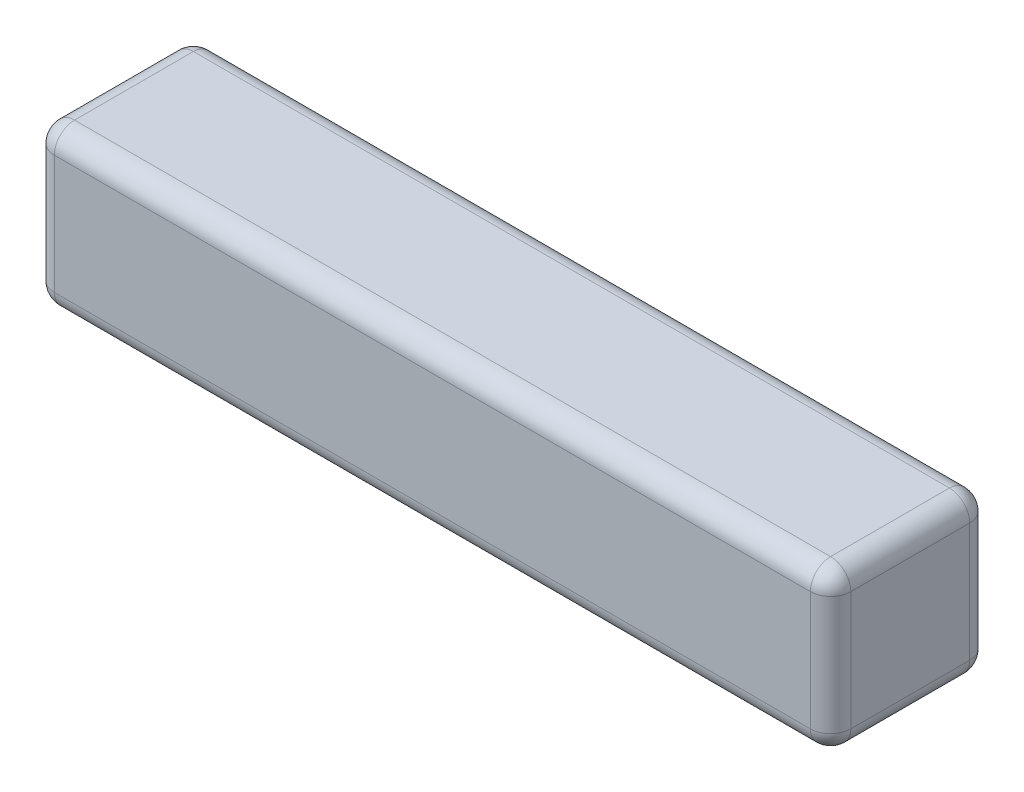
ISO-10303-21;
HEADER;
FILE_DESCRIPTION(('STEP AP214'),'2;1');
FILE_NAME('part.step','',(''),(''),'','','');
FILE_SCHEMA(('AUTOMOTIVE_DESIGN { 1 0 10303 214 1 1 1 1 }'));
ENDSEC;
DATA;
#1=APPLICATION_CONTEXT('core data for automotive mechanical design processes');
#2=APPLICATION_PROTOCOL_DEFINITION('international standard','automotive_design',2000,#1);
#3=PRODUCT_CONTEXT('',#1,'mechanical');
#4=PRODUCT('Part','Part','',(#3));
#5=PRODUCT_RELATED_PRODUCT_CATEGORY('part','',(#4));
#6=PRODUCT_DEFINITION_FORMATION('','',#4);
#7=PRODUCT_DEFINITION_CONTEXT('part definition',#1,'design');
#8=PRODUCT_DEFINITION('design','',#6,#7);
#9=PRODUCT_DEFINITION_SHAPE('','',#8);
#10=(LENGTH_UNIT() NAMED_UNIT(*) SI_UNIT(.MILLI.,.METRE.));
#11=(NAMED_UNIT(*) PLANE_ANGLE_UNIT() SI_UNIT($,.RADIAN.));
#12=(NAMED_UNIT(*) SI_UNIT($,.STERADIAN.) SOLID_ANGLE_UNIT());
#13=UNCERTAINTY_MEASURE_WITH_UNIT(LENGTH_MEASURE(1.E-05),#10,'distance_accuracy_value','');
#14=(GEOMETRIC_REPRESENTATION_CONTEXT(3) GLOBAL_UNCERTAINTY_ASSIGNED_CONTEXT((#13)) GLOBAL_UNIT_ASSIGNED_CONTEXT((#10,
#11,#12)) REPRESENTATION_CONTEXT('',''));
#15=CARTESIAN_POINT('',(0.,0.,0.));
#16=DIRECTION('',(0.,0.,1.));
#17=DIRECTION('',(1.,0.,0.));
#18=AXIS2_PLACEMENT_3D('',#15,#16,#17);
#19=CARTESIAN_POINT('',(9.746,-21.0707501147141,-3.74600000000002));
#20=DIRECTION('',(1.,0.,0.));
#21=DIRECTION('',(0.,0.,-1.));
#22=AXIS2_PLACEMENT_3D('',#19,#20,#21);
#23=SPHERICAL_SURFACE('',#22,0.254);
#24=CARTESIAN_POINT('',(9.746,-21.0707501147141,-3.74600000000002));
#25=DIRECTION('',(0.,0.,-1.));
#26=DIRECTION('',(0.,1.,0.));
#27=AXIS2_PLACEMENT_3D('',#24,#25,#26);
#28=CIRCLE('',#27,0.254000000000001);
#29=CARTESIAN_POINT('',(10.,-21.0707501147141,-3.74600000000002));
#30=VERTEX_POINT('',#29);
#31=CARTESIAN_POINT('',(9.746,-20.8167501147141,-3.74600000000001));
#32=VERTEX_POINT('',#31);
#33=EDGE_CURVE('E296',#30,#32,#28,.F.);
#34=ORIENTED_EDGE('',*,*,#33,.F.);
#35=CARTESIAN_POINT('',(9.746,-21.0707501147141,-3.74600000000001));
#36=DIRECTION('',(0.,-1.,0.));
#37=DIRECTION('',(0.,0.,-1.));
#38=AXIS2_PLACEMENT_3D('',#35,#36,#37);
#39=CIRCLE('',#38,0.254);
#40=CARTESIAN_POINT('',(9.746,-21.0707501147141,-4.00000000000002));
#41=VERTEX_POINT('',#40);
#42=EDGE_CURVE('E134',#41,#30,#39,.T.);
#43=ORIENTED_EDGE('',*,*,#42,.F.);
#44=CARTESIAN_POINT('',(9.746,-21.0707501147141,-3.74600000000002));
#45=DIRECTION('',(-1.,0.,0.));
#46=DIRECTION('',(0.,0.,1.));
#47=AXIS2_PLACEMENT_3D('',#44,#45,#46);
#48=CIRCLE('',#47,0.254);
#49=EDGE_CURVE('E104',#32,#41,#48,.T.);
#50=ORIENTED_EDGE('',*,*,#49,.F.);
#51=EDGE_LOOP('',(#34,#43,#50));
#52=FACE_BOUND('',#51,.T.);
#53=ADVANCED_FACE('F17',(#52),#23,.T.);
#54=CARTESIAN_POINT('',(9.746,-22.5627501147141,-3.74600000000002));
#55=DIRECTION('',(1.,0.,0.));
#56=DIRECTION('',(0.,0.,-1.));
#57=AXIS2_PLACEMENT_3D('',#54,#55,#56);
#58=SPHERICAL_SURFACE('',#57,0.254);
#59=CARTESIAN_POINT('',(9.746,-22.5627501147141,-3.74600000000001));
#60=DIRECTION('',(0.,0.,1.));
#61=DIRECTION('',(0.,-1.,0.));
#62=AXIS2_PLACEMENT_3D('',#59,#60,#61);
#63=CIRCLE('',#62,0.254000000000001);
#64=CARTESIAN_POINT('',(9.746,-22.8167501147141,-3.74600000000001));
#65=VERTEX_POINT('',#64);
#66=CARTESIAN_POINT('',(10.,-22.5627501147141,-3.74600000000002));
#67=VERTEX_POINT('',#66);
#68=EDGE_CURVE('E288',#65,#67,#63,.T.);
#69=ORIENTED_EDGE('',*,*,#68,.F.);
#70=CARTESIAN_POINT('',(9.746,-22.5627501147141,-3.74600000000002));
#71=DIRECTION('',(-1.,0.,0.));
#72=DIRECTION('',(0.,0.,1.));
#73=AXIS2_PLACEMENT_3D('',#70,#71,#72);
#74=CIRCLE('',#73,0.254);
#75=CARTESIAN_POINT('',(9.746,-22.5627501147141,-4.00000000000001));
#76=VERTEX_POINT('',#75);
#77=EDGE_CURVE('E287',#76,#65,#74,.T.);
#78=ORIENTED_EDGE('',*,*,#77,.F.);
#79=CARTESIAN_POINT('',(9.746,-22.5627501147141,-3.74600000000001));
#80=DIRECTION('',(0.,-1.,0.));
#81=DIRECTION('',(0.,0.,-1.));
#82=AXIS2_PLACEMENT_3D('',#79,#80,#81);
#83=CIRCLE('',#82,0.254);
#84=EDGE_CURVE('E283',#67,#76,#83,.F.);
#85=ORIENTED_EDGE('',*,*,#84,.F.);
#86=EDGE_LOOP('',(#69,#78,#85));
#87=FACE_BOUND('',#86,.T.);
#88=ADVANCED_FACE('F155',(#87),#58,.T.);
#89=CARTESIAN_POINT('',(10.,-20.8167501147141,-4.00000000000002));
#90=DIRECTION('',(0.,0.,1.));
#91=DIRECTION('',(0.,-1.,0.));
#92=AXIS2_PLACEMENT_3D('',#89,#90,#91);
#93=PLANE('',#92);
#94=DIRECTION('',(-1.,0.,0.));
#95=VECTOR('',#94,1.);
#96=CARTESIAN_POINT('',(10.,-22.5627501147141,-4.00000000000002));
#97=LINE('',#96,#95);
#98=CARTESIAN_POINT('',(0.254000000000004,-22.5627501147141,-4.00000000000002));
#99=VERTEX_POINT('',#98);
#100=EDGE_CURVE('E117',#99,#76,#97,.F.);
#101=ORIENTED_EDGE('',*,*,#100,.F.);
#102=DIRECTION('',(0.,-1.,0.));
#103=VECTOR('',#102,1.);
#104=CARTESIAN_POINT('',(0.254000000000004,-20.8167501147141,-4.00000000000002));
#105=LINE('',#104,#103);
#106=CARTESIAN_POINT('',(0.254000000000004,-21.0707501147141,-4.00000000000002));
#107=VERTEX_POINT('',#106);
#108=EDGE_CURVE('E111',#107,#99,#105,.T.);
#109=ORIENTED_EDGE('',*,*,#108,.F.);
#110=DIRECTION('',(-1.,0.,0.));
#111=VECTOR('',#110,1.);
#112=CARTESIAN_POINT('',(10.,-21.0707501147141,-4.00000000000002));
#113=LINE('',#112,#111);
#114=EDGE_CURVE('E115',#41,#107,#113,.T.);
#115=ORIENTED_EDGE('',*,*,#114,.F.);
#116=DIRECTION('',(0.,-1.,0.));
#117=VECTOR('',#116,1.);
#118=CARTESIAN_POINT('',(9.746,-22.8167501147141,-4.00000000000001));
#119=LINE('',#118,#117);
#120=EDGE_CURVE('E285',#76,#41,#119,.F.);
#121=ORIENTED_EDGE('',*,*,#120,.F.);
#122=EDGE_LOOP('',(#101,#109,#115,#121));
#123=FACE_BOUND('',#122,.T.);
#124=ADVANCED_FACE('F113',(#123),#93,.F.);
#125=CARTESIAN_POINT('',(0.254000000000004,-21.0707501147141,-3.74600000000002));
#126=DIRECTION('',(1.,0.,0.));
#127=DIRECTION('',(0.,0.,-1.));
#128=AXIS2_PLACEMENT_3D('',#125,#126,#127);
#129=SPHERICAL_SURFACE('',#128,0.254);
#130=CARTESIAN_POINT('',(0.254000000000004,-21.0707501147141,-3.74600000000002));
#131=DIRECTION('',(-1.,0.,0.));
#132=DIRECTION('',(0.,0.,1.));
#133=AXIS2_PLACEMENT_3D('',#130,#131,#132);
#134=CIRCLE('',#133,0.254);
#135=CARTESIAN_POINT('',(0.254000000000004,-20.8167501147141,-3.74600000000001));
#136=VERTEX_POINT('',#135);
#137=EDGE_CURVE('E119',#107,#136,#134,.F.);
#138=ORIENTED_EDGE('',*,*,#137,.F.);
#139=CARTESIAN_POINT('',(0.254000000000004,-21.0707501147141,-3.74600000000001));
#140=DIRECTION('',(0.,1.,0.));
#141=DIRECTION('',(0.,0.,1.));
#142=AXIS2_PLACEMENT_3D('',#139,#140,#141);
#143=CIRCLE('',#142,0.254);
#144=CARTESIAN_POINT('',(0.,-21.0707501147141,-3.74600000000001));
#145=VERTEX_POINT('',#144);
#146=EDGE_CURVE('E123',#145,#107,#143,.F.);
#147=ORIENTED_EDGE('',*,*,#146,.F.);
#148=CARTESIAN_POINT('',(0.254000000000004,-21.0707501147141,-3.74600000000001));
#149=DIRECTION('',(0.,0.,1.));
#150=DIRECTION('',(0.,-1.,0.));
#151=AXIS2_PLACEMENT_3D('',#148,#149,#150);
#152=CIRCLE('',#151,0.254);
#153=EDGE_CURVE('E137',#136,#145,#152,.T.);
#154=ORIENTED_EDGE('',*,*,#153,.F.);
#155=EDGE_LOOP('',(#138,#147,#154));
#156=FACE_BOUND('',#155,.T.);
#157=ADVANCED_FACE('F136',(#156),#129,.T.);
#158=CARTESIAN_POINT('',(0.254000000000004,-22.5627501147141,-3.74600000000002));
#159=DIRECTION('',(1.,0.,0.));
#160=DIRECTION('',(0.,0.,-1.));
#161=AXIS2_PLACEMENT_3D('',#158,#159,#160);
#162=SPHERICAL_SURFACE('',#161,0.254);
#163=CARTESIAN_POINT('',(0.254000000000004,-22.5627501147141,-3.74600000000001));
#164=DIRECTION('',(0.,1.,0.));
#165=DIRECTION('',(0.,0.,1.));
#166=AXIS2_PLACEMENT_3D('',#163,#164,#165);
#167=CIRCLE('',#166,0.254);
#168=CARTESIAN_POINT('',(0.,-22.5627501147141,-3.74600000000002));
#169=VERTEX_POINT('',#168);
#170=EDGE_CURVE('E130',#99,#169,#167,.T.);
#171=ORIENTED_EDGE('',*,*,#170,.F.);
#172=CARTESIAN_POINT('',(0.254000000000004,-22.5627501147141,-3.74600000000002));
#173=DIRECTION('',(-1.,0.,0.));
#174=DIRECTION('',(0.,0.,1.));
#175=AXIS2_PLACEMENT_3D('',#172,#173,#174);
#176=CIRCLE('',#175,0.254);
#177=CARTESIAN_POINT('',(0.254000000000004,-22.8167501147141,-3.74600000000001));
#178=VERTEX_POINT('',#177);
#179=EDGE_CURVE('E291',#178,#99,#176,.F.);
#180=ORIENTED_EDGE('',*,*,#179,.F.);
#181=CARTESIAN_POINT('',(0.254000000000004,-22.5627501147141,-3.74600000000002));
#182=DIRECTION('',(0.,0.,-1.));
#183=DIRECTION('',(0.,1.,0.));
#184=AXIS2_PLACEMENT_3D('',#181,#182,#183);
#185=CIRCLE('',#184,0.254);
#186=EDGE_CURVE('E131',#169,#178,#185,.F.);
#187=ORIENTED_EDGE('',*,*,#186,.F.);
#188=EDGE_LOOP('',(#171,#180,#187));
#189=FACE_BOUND('',#188,.T.);
#190=ADVANCED_FACE('F146',(#189),#162,.T.);
#191=CARTESIAN_POINT('',(10.,-21.0707501147141,-3.74600000000002));
#192=DIRECTION('',(-1.,0.,0.));
#193=DIRECTION('',(0.,0.,1.));
#194=AXIS2_PLACEMENT_3D('',#191,#192,#193);
#195=CYLINDRICAL_SURFACE('',#194,0.254);
#196=ORIENTED_EDGE('',*,*,#49,.T.);
#197=ORIENTED_EDGE('',*,*,#114,.T.);
#198=ORIENTED_EDGE('',*,*,#137,.T.);
#199=DIRECTION('',(1.,0.,0.));
#200=VECTOR('',#199,1.);
#201=CARTESIAN_POINT('',(10.,-20.8167501147141,-3.74600000000001));
#202=LINE('',#201,#200);
#203=EDGE_CURVE('E378',#136,#32,#202,.T.);
#204=ORIENTED_EDGE('',*,*,#203,.T.);
#205=EDGE_LOOP('',(#196,#197,#198,#204));
#206=FACE_BOUND('',#205,.T.);
#207=ADVANCED_FACE('F133',(#206),#195,.T.);
#208=CARTESIAN_POINT('',(9.746,-22.8167501147141,-3.74600000000001));
#209=DIRECTION('',(0.,-1.,0.));
#210=DIRECTION('',(0.,0.,-1.));
#211=AXIS2_PLACEMENT_3D('',#208,#209,#210);
#212=CYLINDRICAL_SURFACE('',#211,0.254);
#213=ORIENTED_EDGE('',*,*,#84,.T.);
#214=ORIENTED_EDGE('',*,*,#120,.T.);
#215=ORIENTED_EDGE('',*,*,#42,.T.);
#216=DIRECTION('',(0.,1.,0.));
#217=VECTOR('',#216,1.);
#218=CARTESIAN_POINT('',(10.,-22.8167501147141,-3.74600000000002));
#219=LINE('',#218,#217);
#220=EDGE_CURVE('E235',#67,#30,#219,.T.);
#221=ORIENTED_EDGE('',*,*,#220,.F.);
#222=EDGE_LOOP('',(#213,#214,#215,#221));
#223=FACE_BOUND('',#222,.T.);
#224=ADVANCED_FACE('F273',(#223),#212,.T.);
#225=CARTESIAN_POINT('',(9.746,-21.0707501147141,-2.00000000000002));
#226=DIRECTION('',(0.,0.,-1.));
#227=DIRECTION('',(0.,1.,0.));
#228=AXIS2_PLACEMENT_3D('',#225,#226,#227);
#229=CYLINDRICAL_SURFACE('',#228,0.254000000000001);
#230=ORIENTED_EDGE('',*,*,#33,.T.);
#231=DIRECTION('',(0.,0.,-1.));
#232=VECTOR('',#231,1.);
#233=CARTESIAN_POINT('',(9.746,-20.8167501147141,-2.00000000000002));
#234=LINE('',#233,#232);
#235=CARTESIAN_POINT('',(9.746,-20.8167501147141,-2.25400000000001));
#236=VERTEX_POINT('',#235);
#237=EDGE_CURVE('E310',#32,#236,#234,.F.);
#238=ORIENTED_EDGE('',*,*,#237,.T.);
#239=CARTESIAN_POINT('',(9.746,-21.0707501147141,-2.25400000000001));
#240=DIRECTION('',(0.,0.,1.));
#241=DIRECTION('',(1.,0.,0.));
#242=AXIS2_PLACEMENT_3D('',#239,#240,#241);
#243=CIRCLE('',#242,0.254);
#244=CARTESIAN_POINT('',(10.,-21.0707501147141,-2.25400000000001));
#245=VERTEX_POINT('',#244);
#246=EDGE_CURVE('E241',#245,#236,#243,.T.);
#247=ORIENTED_EDGE('',*,*,#246,.F.);
#248=DIRECTION('',(0.,0.,-1.));
#249=VECTOR('',#248,1.);
#250=CARTESIAN_POINT('',(10.,-21.0707501147141,-2.00000000000001));
#251=LINE('',#250,#249);
#252=EDGE_CURVE('E233',#30,#245,#251,.F.);
#253=ORIENTED_EDGE('',*,*,#252,.F.);
#254=EDGE_LOOP('',(#230,#238,#247,#253));
#255=FACE_BOUND('',#254,.T.);
#256=ADVANCED_FACE('F270',(#255),#229,.T.);
#257=CARTESIAN_POINT('',(9.746,-22.5627501147141,-2.00000000000001));
#258=DIRECTION('',(0.,0.,1.));
#259=DIRECTION('',(0.,-1.,0.));
#260=AXIS2_PLACEMENT_3D('',#257,#258,#259);
#261=CYLINDRICAL_SURFACE('',#260,0.254000000000001);
#262=ORIENTED_EDGE('',*,*,#68,.T.);
#263=DIRECTION('',(0.,0.,-1.));
#264=VECTOR('',#263,1.);
#265=CARTESIAN_POINT('',(10.,-22.5627501147141,-2.00000000000001));
#266=LINE('',#265,#264);
#267=CARTESIAN_POINT('',(10.,-22.5627501147141,-2.25400000000001));
#268=VERTEX_POINT('',#267);
#269=EDGE_CURVE('E238',#268,#67,#266,.T.);
#270=ORIENTED_EDGE('',*,*,#269,.F.);
#271=CARTESIAN_POINT('',(9.746,-22.5627501147141,-2.25400000000001));
#272=DIRECTION('',(0.,0.,-1.));
#273=DIRECTION('',(1.,0.,0.));
#274=AXIS2_PLACEMENT_3D('',#271,#272,#273);
#275=CIRCLE('',#274,0.254);
#276=CARTESIAN_POINT('',(9.746,-22.8167501147141,-2.25400000000001));
#277=VERTEX_POINT('',#276);
#278=EDGE_CURVE('E231',#277,#268,#275,.F.);
#279=ORIENTED_EDGE('',*,*,#278,.F.);
#280=DIRECTION('',(0.,0.,1.));
#281=VECTOR('',#280,1.);
#282=CARTESIAN_POINT('',(9.746,-22.8167501147141,-2.00000000000001));
#283=LINE('',#282,#281);
#284=EDGE_CURVE('E229',#277,#65,#283,.F.);
#285=ORIENTED_EDGE('',*,*,#284,.T.);
#286=EDGE_LOOP('',(#262,#270,#279,#285));
#287=FACE_BOUND('',#286,.T.);
#288=ADVANCED_FACE('F266',(#287),#261,.T.);
#289=CARTESIAN_POINT('',(10.,-22.5627501147141,-3.74600000000002));
#290=DIRECTION('',(-1.,0.,0.));
#291=DIRECTION('',(0.,0.,1.));
#292=AXIS2_PLACEMENT_3D('',#289,#290,#291);
#293=CYLINDRICAL_SURFACE('',#292,0.254);
#294=ORIENTED_EDGE('',*,*,#179,.T.);
#295=ORIENTED_EDGE('',*,*,#100,.T.);
#296=ORIENTED_EDGE('',*,*,#77,.T.);
#297=DIRECTION('',(1.,0.,0.));
#298=VECTOR('',#297,1.);
#299=CARTESIAN_POINT('',(10.,-22.8167501147141,-3.74600000000001));
#300=LINE('',#299,#298);
#301=EDGE_CURVE('E373',#65,#178,#300,.F.);
#302=ORIENTED_EDGE('',*,*,#301,.T.);
#303=EDGE_LOOP('',(#294,#295,#296,#302));
#304=FACE_BOUND('',#303,.T.);
#305=ADVANCED_FACE('F262',(#304),#293,.T.);
#306=CARTESIAN_POINT('',(0.254000000000004,-21.0707501147141,-2.00000000000002));
#307=DIRECTION('',(0.,0.,1.));
#308=DIRECTION('',(0.,-1.,0.));
#309=AXIS2_PLACEMENT_3D('',#306,#307,#308);
#310=CYLINDRICAL_SURFACE('',#309,0.254);
#311=ORIENTED_EDGE('',*,*,#153,.T.);
#312=DIRECTION('',(0.,0.,-1.));
#313=VECTOR('',#312,1.);
#314=CARTESIAN_POINT('',(0.,-21.0707501147141,-2.00000000000001));
#315=LINE('',#314,#313);
#316=CARTESIAN_POINT('',(0.,-21.0707501147141,-2.25400000000001));
#317=VERTEX_POINT('',#316);
#318=EDGE_CURVE('E204',#145,#317,#315,.F.);
#319=ORIENTED_EDGE('',*,*,#318,.T.);
#320=CARTESIAN_POINT('',(0.254000000000004,-21.0707501147141,-2.25400000000001));
#321=DIRECTION('',(0.,0.,1.));
#322=DIRECTION('',(1.,0.,0.));
#323=AXIS2_PLACEMENT_3D('',#320,#321,#322);
#324=CIRCLE('',#323,0.254);
#325=CARTESIAN_POINT('',(0.254000000000004,-20.8167501147141,-2.25400000000001));
#326=VERTEX_POINT('',#325);
#327=EDGE_CURVE('E207',#326,#317,#324,.T.);
#328=ORIENTED_EDGE('',*,*,#327,.F.);
#329=DIRECTION('',(0.,0.,-1.));
#330=VECTOR('',#329,1.);
#331=CARTESIAN_POINT('',(0.254000000000004,-20.8167501147141,-2.00000000000002));
#332=LINE('',#331,#330);
#333=EDGE_CURVE('E376',#326,#136,#332,.T.);
#334=ORIENTED_EDGE('',*,*,#333,.T.);
#335=EDGE_LOOP('',(#311,#319,#328,#334));
#336=FACE_BOUND('',#335,.T.);
#337=ADVANCED_FACE('F258',(#336),#310,.T.);
#338=CARTESIAN_POINT('',(0.254000000000004,-22.5627501147141,-2.00000000000001));
#339=DIRECTION('',(0.,0.,-1.));
#340=DIRECTION('',(0.,1.,0.));
#341=AXIS2_PLACEMENT_3D('',#338,#339,#340);
#342=CYLINDRICAL_SURFACE('',#341,0.254);
#343=ORIENTED_EDGE('',*,*,#186,.T.);
#344=DIRECTION('',(0.,0.,1.));
#345=VECTOR('',#344,1.);
#346=CARTESIAN_POINT('',(0.254000000000004,-22.8167501147141,-2.00000000000001));
#347=LINE('',#346,#345);
#348=CARTESIAN_POINT('',(0.254000000000004,-22.8167501147141,-2.25400000000001));
#349=VERTEX_POINT('',#348);
#350=EDGE_CURVE('E367',#178,#349,#347,.T.);
#351=ORIENTED_EDGE('',*,*,#350,.T.);
#352=CARTESIAN_POINT('',(0.254000000000004,-22.5627501147141,-2.25400000000001));
#353=DIRECTION('',(0.,0.,-1.));
#354=DIRECTION('',(0.,1.,0.));
#355=AXIS2_PLACEMENT_3D('',#352,#353,#354);
#356=CIRCLE('',#355,0.254);
#357=CARTESIAN_POINT('',(0.,-22.5627501147141,-2.25400000000001));
#358=VERTEX_POINT('',#357);
#359=EDGE_CURVE('E365',#349,#358,#356,.T.);
#360=ORIENTED_EDGE('',*,*,#359,.T.);
#361=DIRECTION('',(0.,0.,-1.));
#362=VECTOR('',#361,1.);
#363=CARTESIAN_POINT('',(0.,-22.5627501147141,-2.00000000000001));
#364=LINE('',#363,#362);
#365=EDGE_CURVE('E201',#358,#169,#364,.T.);
#366=ORIENTED_EDGE('',*,*,#365,.T.);
#367=EDGE_LOOP('',(#343,#351,#360,#366));
#368=FACE_BOUND('',#367,.T.);
#369=ADVANCED_FACE('F255',(#368),#342,.T.);
#370=CARTESIAN_POINT('',(0.254000000000004,-20.8167501147141,-3.74600000000001));
#371=DIRECTION('',(0.,1.,0.));
#372=DIRECTION('',(0.,0.,1.));
#373=AXIS2_PLACEMENT_3D('',#370,#371,#372);
#374=CYLINDRICAL_SURFACE('',#373,0.254);
#375=ORIENTED_EDGE('',*,*,#170,.T.);
#376=DIRECTION('',(0.,1.,0.));
#377=VECTOR('',#376,1.);
#378=CARTESIAN_POINT('',(0.,-22.8167501147141,-3.74600000000002));
#379=LINE('',#378,#377);
#380=EDGE_CURVE('E126',#169,#145,#379,.T.);
#381=ORIENTED_EDGE('',*,*,#380,.T.);
#382=ORIENTED_EDGE('',*,*,#146,.T.);
#383=ORIENTED_EDGE('',*,*,#108,.T.);
#384=EDGE_LOOP('',(#375,#381,#382,#383));
#385=FACE_BOUND('',#384,.T.);
#386=ADVANCED_FACE('F124',(#385),#374,.T.);
#387=CARTESIAN_POINT('',(10.,-20.8167501147141,-2.00000000000002));
#388=DIRECTION('',(0.,-1.,0.));
#389=DIRECTION('',(0.,0.,-1.));
#390=AXIS2_PLACEMENT_3D('',#387,#388,#389);
#391=PLANE('',#390);
#392=ORIENTED_EDGE('',*,*,#203,.F.);
#393=ORIENTED_EDGE('',*,*,#333,.F.);
#394=DIRECTION('',(-1.,0.,0.));
#395=VECTOR('',#394,1.);
#396=CARTESIAN_POINT('',(10.,-20.8167501147141,-2.25400000000002));
#397=LINE('',#396,#395);
#398=EDGE_CURVE('E327',#236,#326,#397,.T.);
#399=ORIENTED_EDGE('',*,*,#398,.F.);
#400=ORIENTED_EDGE('',*,*,#237,.F.);
#401=EDGE_LOOP('',(#392,#393,#399,#400));
#402=FACE_BOUND('',#401,.T.);
#403=ADVANCED_FACE('F248',(#402),#391,.F.);
#404=CARTESIAN_POINT('',(9.746,-21.0707501147141,-2.25400000000001));
#405=DIRECTION('',(1.,0.,0.));
#406=DIRECTION('',(0.,0.,-1.));
#407=AXIS2_PLACEMENT_3D('',#404,#405,#406);
#408=SPHERICAL_SURFACE('',#407,0.254);
#409=CARTESIAN_POINT('',(9.746,-21.0707501147141,-2.25400000000001));
#410=DIRECTION('',(-1.,0.,0.));
#411=DIRECTION('',(0.,0.,1.));
#412=AXIS2_PLACEMENT_3D('',#409,#410,#411);
#413=CIRCLE('',#412,0.254);
#414=CARTESIAN_POINT('',(9.746,-21.0707501147141,-2.00000000000001));
#415=VERTEX_POINT('',#414);
#416=EDGE_CURVE('E198',#415,#236,#413,.T.);
#417=ORIENTED_EDGE('',*,*,#416,.F.);
#418=CARTESIAN_POINT('',(9.746,-21.0707501147141,-2.25400000000001));
#419=DIRECTION('',(0.,1.,0.));
#420=DIRECTION('',(0.,0.,1.));
#421=AXIS2_PLACEMENT_3D('',#418,#419,#420);
#422=CIRCLE('',#421,0.254);
#423=EDGE_CURVE('E318',#245,#415,#422,.F.);
#424=ORIENTED_EDGE('',*,*,#423,.F.);
#425=ORIENTED_EDGE('',*,*,#246,.T.);
#426=EDGE_LOOP('',(#417,#424,#425));
#427=FACE_BOUND('',#426,.T.);
#428=ADVANCED_FACE('F245',(#427),#408,.T.);
#429=CARTESIAN_POINT('',(10.,-22.8167501147141,-2.00000000000001));
#430=DIRECTION('',(1.,0.,0.));
#431=DIRECTION('',(0.,0.,-1.));
#432=AXIS2_PLACEMENT_3D('',#429,#430,#431);
#433=PLANE('',#432);
#434=ORIENTED_EDGE('',*,*,#252,.T.);
#435=DIRECTION('',(0.,1.,0.));
#436=VECTOR('',#435,1.);
#437=CARTESIAN_POINT('',(10.,-22.8167501147141,-2.25400000000001));
#438=LINE('',#437,#436);
#439=EDGE_CURVE('E316',#268,#245,#438,.T.);
#440=ORIENTED_EDGE('',*,*,#439,.F.);
#441=ORIENTED_EDGE('',*,*,#269,.T.);
#442=ORIENTED_EDGE('',*,*,#220,.T.);
#443=EDGE_LOOP('',(#434,#440,#441,#442));
#444=FACE_BOUND('',#443,.T.);
#445=ADVANCED_FACE('F223',(#444),#433,.T.);
#446=CARTESIAN_POINT('',(9.746,-22.5627501147141,-2.25400000000001));
#447=DIRECTION('',(1.,0.,0.));
#448=DIRECTION('',(0.,0.,-1.));
#449=AXIS2_PLACEMENT_3D('',#446,#447,#448);
#450=SPHERICAL_SURFACE('',#449,0.254);
#451=CARTESIAN_POINT('',(9.746,-22.5627501147141,-2.25400000000001));
#452=DIRECTION('',(-1.,0.,0.));
#453=DIRECTION('',(0.,0.,1.));
#454=AXIS2_PLACEMENT_3D('',#451,#452,#453);
#455=CIRCLE('',#454,0.254);
#456=CARTESIAN_POINT('',(9.746,-22.5627501147018,-2.00000000000001));
#457=VERTEX_POINT('',#456);
#458=EDGE_CURVE('E321',#277,#457,#455,.T.);
#459=ORIENTED_EDGE('',*,*,#458,.F.);
#460=ORIENTED_EDGE('',*,*,#278,.T.);
#461=CARTESIAN_POINT('',(9.746,-22.5627501147141,-2.25400000000001));
#462=DIRECTION('',(0.,1.,0.));
#463=DIRECTION('',(0.,0.,1.));
#464=AXIS2_PLACEMENT_3D('',#461,#462,#463);
#465=CIRCLE('',#464,0.254);
#466=EDGE_CURVE('E320',#457,#268,#465,.T.);
#467=ORIENTED_EDGE('',*,*,#466,.F.);
#468=EDGE_LOOP('',(#459,#460,#467));
#469=FACE_BOUND('',#468,.T.);
#470=ADVANCED_FACE('F218',(#469),#450,.T.);
#471=CARTESIAN_POINT('',(10.,-22.8167501147141,-2.00000000000001));
#472=DIRECTION('',(0.,1.,0.));
#473=DIRECTION('',(0.,0.,1.));
#474=AXIS2_PLACEMENT_3D('',#471,#472,#473);
#475=PLANE('',#474);
#476=ORIENTED_EDGE('',*,*,#301,.F.);
#477=ORIENTED_EDGE('',*,*,#284,.F.);
#478=DIRECTION('',(-1.,0.,0.));
#479=VECTOR('',#478,1.);
#480=CARTESIAN_POINT('',(10.,-22.8167501147141,-2.25400000000001));
#481=LINE('',#480,#479);
#482=EDGE_CURVE('E348',#349,#277,#481,.F.);
#483=ORIENTED_EDGE('',*,*,#482,.F.);
#484=ORIENTED_EDGE('',*,*,#350,.F.);
#485=EDGE_LOOP('',(#476,#477,#483,#484));
#486=FACE_BOUND('',#485,.T.);
#487=ADVANCED_FACE('F214',(#486),#475,.F.);
#488=CARTESIAN_POINT('',(0.254000000000004,-21.0707501147141,-2.25400000000001));
#489=DIRECTION('',(1.,0.,0.));
#490=DIRECTION('',(0.,0.,-1.));
#491=AXIS2_PLACEMENT_3D('',#488,#489,#490);
#492=SPHERICAL_SURFACE('',#491,0.254);
#493=CARTESIAN_POINT('',(0.254000000000004,-21.0707501147141,-2.25400000000001));
#494=DIRECTION('',(-1.,0.,0.));
#495=DIRECTION('',(0.,0.,1.));
#496=AXIS2_PLACEMENT_3D('',#493,#494,#495);
#497=CIRCLE('',#496,0.254);
#498=CARTESIAN_POINT('',(0.254000000000004,-21.0707501147018,-2.00000000000001));
#499=VERTEX_POINT('',#498);
#500=EDGE_CURVE('E324',#326,#499,#497,.F.);
#501=ORIENTED_EDGE('',*,*,#500,.F.);
#502=ORIENTED_EDGE('',*,*,#327,.T.);
#503=CARTESIAN_POINT('',(0.254000000000004,-21.0707501147141,-2.25400000000002));
#504=DIRECTION('',(0.,-1.,0.));
#505=DIRECTION('',(0.,0.,-1.));
#506=AXIS2_PLACEMENT_3D('',#503,#504,#505);
#507=CIRCLE('',#506,0.254);
#508=EDGE_CURVE('E345',#499,#317,#507,.T.);
#509=ORIENTED_EDGE('',*,*,#508,.F.);
#510=EDGE_LOOP('',(#501,#502,#509));
#511=FACE_BOUND('',#510,.T.);
#512=ADVANCED_FACE('F211',(#511),#492,.T.);
#513=CARTESIAN_POINT('',(0.,-22.8167501147141,-2.00000000000001));
#514=DIRECTION('',(1.,0.,0.));
#515=DIRECTION('',(0.,0.,-1.));
#516=AXIS2_PLACEMENT_3D('',#513,#514,#515);
#517=PLANE('',#516);
#518=ORIENTED_EDGE('',*,*,#365,.F.);
#519=DIRECTION('',(0.,-1.,0.));
#520=VECTOR('',#519,1.);
#521=CARTESIAN_POINT('',(0.,-20.8167501147141,-2.25400000000001));
#522=LINE('',#521,#520);
#523=EDGE_CURVE('E340',#317,#358,#522,.T.);
#524=ORIENTED_EDGE('',*,*,#523,.F.);
#525=ORIENTED_EDGE('',*,*,#318,.F.);
#526=ORIENTED_EDGE('',*,*,#380,.F.);
#527=EDGE_LOOP('',(#518,#524,#525,#526));
#528=FACE_BOUND('',#527,.T.);
#529=ADVANCED_FACE('F192',(#528),#517,.F.);
#530=CARTESIAN_POINT('',(0.254000000000004,-22.5627501147141,-2.25400000000001));
#531=DIRECTION('',(1.,0.,0.));
#532=DIRECTION('',(0.,0.,-1.));
#533=AXIS2_PLACEMENT_3D('',#530,#531,#532);
#534=SPHERICAL_SURFACE('',#533,0.254);
#535=CARTESIAN_POINT('',(0.254000000000004,-22.5627501147141,-2.25400000000002));
#536=DIRECTION('',(0.,-1.,0.));
#537=DIRECTION('',(0.,0.,-1.));
#538=AXIS2_PLACEMENT_3D('',#535,#536,#537);
#539=CIRCLE('',#538,0.254);
#540=CARTESIAN_POINT('',(0.254000000000004,-22.5627501147141,-2.00000000000001));
#541=VERTEX_POINT('',#540);
#542=EDGE_CURVE('E34',#358,#541,#539,.F.);
#543=ORIENTED_EDGE('',*,*,#542,.F.);
#544=ORIENTED_EDGE('',*,*,#359,.F.);
#545=CARTESIAN_POINT('',(0.254000000000004,-22.5627501147141,-2.25400000000001));
#546=DIRECTION('',(-1.,0.,0.));
#547=DIRECTION('',(0.,0.,1.));
#548=AXIS2_PLACEMENT_3D('',#545,#546,#547);
#549=CIRCLE('',#548,0.254);
#550=EDGE_CURVE('E351',#541,#349,#549,.F.);
#551=ORIENTED_EDGE('',*,*,#550,.F.);
#552=EDGE_LOOP('',(#543,#544,#551));
#553=FACE_BOUND('',#552,.T.);
#554=ADVANCED_FACE('F187',(#553),#534,.T.);
#555=CARTESIAN_POINT('',(10.,-21.0707501147141,-2.25400000000001));
#556=DIRECTION('',(-1.,0.,0.));
#557=DIRECTION('',(0.,0.,1.));
#558=AXIS2_PLACEMENT_3D('',#555,#556,#557);
#559=CYLINDRICAL_SURFACE('',#558,0.254);
#560=ORIENTED_EDGE('',*,*,#500,.T.);
#561=DIRECTION('',(1.,0.,0.));
#562=VECTOR('',#561,1.);
#563=CARTESIAN_POINT('',(10.,-21.0707501147141,-2.00000000000002));
#564=LINE('',#563,#562);
#565=EDGE_CURVE('E333',#499,#415,#564,.T.);
#566=ORIENTED_EDGE('',*,*,#565,.T.);
#567=ORIENTED_EDGE('',*,*,#416,.T.);
#568=ORIENTED_EDGE('',*,*,#398,.T.);
#569=EDGE_LOOP('',(#560,#566,#567,#568));
#570=FACE_BOUND('',#569,.T.);
#571=ADVANCED_FACE('F183',(#570),#559,.T.);
#572=CARTESIAN_POINT('',(9.746,-22.8167501147141,-2.25400000000001));
#573=DIRECTION('',(0.,1.,0.));
#574=DIRECTION('',(0.,0.,1.));
#575=AXIS2_PLACEMENT_3D('',#572,#573,#574);
#576=CYLINDRICAL_SURFACE('',#575,0.254);
#577=ORIENTED_EDGE('',*,*,#466,.T.);
#578=ORIENTED_EDGE('',*,*,#439,.T.);
#579=ORIENTED_EDGE('',*,*,#423,.T.);
#580=DIRECTION('',(0.,1.,0.));
#581=VECTOR('',#580,1.);
#582=CARTESIAN_POINT('',(9.746,-20.8167501147141,-2.00000000000002));
#583=LINE('',#582,#581);
#584=EDGE_CURVE('E337',#415,#457,#583,.F.);
#585=ORIENTED_EDGE('',*,*,#584,.T.);
#586=EDGE_LOOP('',(#577,#578,#579,#585));
#587=FACE_BOUND('',#586,.T.);
#588=ADVANCED_FACE('F179',(#587),#576,.T.);
#589=CARTESIAN_POINT('',(10.,-22.5627501147141,-2.25400000000001));
#590=DIRECTION('',(-1.,0.,0.));
#591=DIRECTION('',(0.,0.,1.));
#592=AXIS2_PLACEMENT_3D('',#589,#590,#591);
#593=CYLINDRICAL_SURFACE('',#592,0.254);
#594=ORIENTED_EDGE('',*,*,#550,.T.);
#595=ORIENTED_EDGE('',*,*,#482,.T.);
#596=ORIENTED_EDGE('',*,*,#458,.T.);
#597=DIRECTION('',(1.,0.,0.));
#598=VECTOR('',#597,1.);
#599=CARTESIAN_POINT('',(10.,-22.5627501147141,-2.00000000000002));
#600=LINE('',#599,#598);
#601=EDGE_CURVE('E26',#457,#541,#600,.F.);
#602=ORIENTED_EDGE('',*,*,#601,.T.);
#603=EDGE_LOOP('',(#594,#595,#596,#602));
#604=FACE_BOUND('',#603,.T.);
#605=ADVANCED_FACE('F173',(#604),#593,.T.);
#606=CARTESIAN_POINT('',(0.254000000000004,-20.8167501147141,-2.25400000000002));
#607=DIRECTION('',(0.,-1.,0.));
#608=DIRECTION('',(0.,0.,-1.));
#609=AXIS2_PLACEMENT_3D('',#606,#607,#608);
#610=CYLINDRICAL_SURFACE('',#609,0.254);
#611=ORIENTED_EDGE('',*,*,#542,.T.);
#612=DIRECTION('',(0.,1.,0.));
#613=VECTOR('',#612,1.);
#614=CARTESIAN_POINT('',(0.254000000000004,-20.8167501147141,-2.00000000000002));
#615=LINE('',#614,#613);
#616=EDGE_CURVE('E11',#541,#499,#615,.T.);
#617=ORIENTED_EDGE('',*,*,#616,.T.);
#618=ORIENTED_EDGE('',*,*,#508,.T.);
#619=ORIENTED_EDGE('',*,*,#523,.T.);
#620=EDGE_LOOP('',(#611,#617,#618,#619));
#621=FACE_BOUND('',#620,.T.);
#622=ADVANCED_FACE('F167',(#621),#610,.T.);
#623=CARTESIAN_POINT('',(10.,-20.8167501147141,-2.00000000000002));
#624=DIRECTION('',(0.,0.,-1.));
#625=DIRECTION('',(0.,1.,0.));
#626=AXIS2_PLACEMENT_3D('',#623,#624,#625);
#627=PLANE('',#626);
#628=ORIENTED_EDGE('',*,*,#601,.F.);
#629=ORIENTED_EDGE('',*,*,#584,.F.);
#630=ORIENTED_EDGE('',*,*,#565,.F.);
#631=ORIENTED_EDGE('',*,*,#616,.F.);
#632=EDGE_LOOP('',(#628,#629,#630,#631));
#633=FACE_BOUND('',#632,.T.);
#634=ADVANCED_FACE('F165',(#633),#627,.F.);
#635=CLOSED_SHELL('',(#53,#88,#124,#157,#190,#207,#224,#256,#288,#305,#337,#369,#386,#403,#428,
#445,#470,#487,#512,#529,#554,#571,#588,#605,#622,#634));
#636=MANIFOLD_SOLID_BREP('B1',#635);
#637=ADVANCED_BREP_SHAPE_REPRESENTATION('',(#18,#636),#14);
#638=SHAPE_DEFINITION_REPRESENTATION(#9,#637);
ENDSEC;
END-ISO-10303-21;
